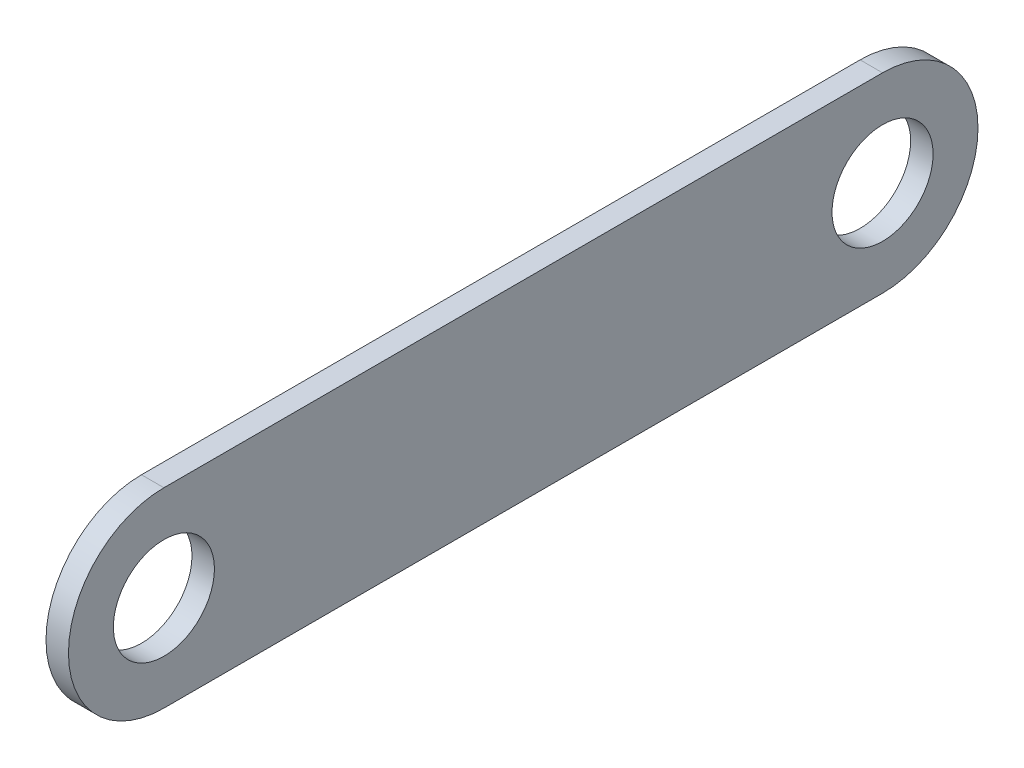
ISO-10303-21;
HEADER;
FILE_DESCRIPTION(('STEP AP214'),'2;1');
FILE_NAME('part.step','',(''),(''),'','','');
FILE_SCHEMA(('AUTOMOTIVE_DESIGN { 1 0 10303 214 1 1 1 1 }'));
ENDSEC;
DATA;
#1=APPLICATION_CONTEXT('core data for automotive mechanical design processes');
#2=APPLICATION_PROTOCOL_DEFINITION('international standard','automotive_design',2000,#1);
#3=PRODUCT_CONTEXT('',#1,'mechanical');
#4=PRODUCT('Part','Part','',(#3));
#5=PRODUCT_RELATED_PRODUCT_CATEGORY('part','',(#4));
#6=PRODUCT_DEFINITION_FORMATION('','',#4);
#7=PRODUCT_DEFINITION_CONTEXT('part definition',#1,'design');
#8=PRODUCT_DEFINITION('design','',#6,#7);
#9=PRODUCT_DEFINITION_SHAPE('','',#8);
#10=(LENGTH_UNIT() NAMED_UNIT(*) SI_UNIT(.MILLI.,.METRE.));
#11=(NAMED_UNIT(*) PLANE_ANGLE_UNIT() SI_UNIT($,.RADIAN.));
#12=(NAMED_UNIT(*) SI_UNIT($,.STERADIAN.) SOLID_ANGLE_UNIT());
#13=UNCERTAINTY_MEASURE_WITH_UNIT(LENGTH_MEASURE(1.E-05),#10,'distance_accuracy_value','');
#14=(GEOMETRIC_REPRESENTATION_CONTEXT(3) GLOBAL_UNCERTAINTY_ASSIGNED_CONTEXT((#13)) GLOBAL_UNIT_ASSIGNED_CONTEXT((#10,
#11,#12)) REPRESENTATION_CONTEXT('',''));
#15=CARTESIAN_POINT('',(0.,0.,0.));
#16=DIRECTION('',(0.,0.,1.));
#17=DIRECTION('',(1.,0.,0.));
#18=AXIS2_PLACEMENT_3D('',#15,#16,#17);
#19=CARTESIAN_POINT('',(6.35,-26.9875,0.));
#20=DIRECTION('',(0.,1.,0.));
#21=DIRECTION('',(0.,0.,1.));
#22=AXIS2_PLACEMENT_3D('',#19,#20,#21);
#23=PLANE('',#22);
#24=DIRECTION('',(0.,0.,-1.));
#25=VECTOR('',#24,1.);
#26=CARTESIAN_POINT('',(0.,-26.9875,0.));
#27=LINE('',#26,#25);
#28=CARTESIAN_POINT('',(0.,-26.9875,0.));
#29=VERTEX_POINT('',#28);
#30=CARTESIAN_POINT('',(0.,-26.9875,-203.2));
#31=VERTEX_POINT('',#30);
#32=EDGE_CURVE('E103',#29,#31,#27,.T.);
#33=ORIENTED_EDGE('',*,*,#32,.T.);
#34=DIRECTION('',(-1.,0.,0.));
#35=VECTOR('',#34,1.);
#36=CARTESIAN_POINT('',(6.35,-26.9875,-203.2));
#37=LINE('',#36,#35);
#38=CARTESIAN_POINT('',(6.35,-26.9875,-203.2));
#39=VERTEX_POINT('',#38);
#40=EDGE_CURVE('E11',#39,#31,#37,.T.);
#41=ORIENTED_EDGE('',*,*,#40,.F.);
#42=DIRECTION('',(0.,0.,-1.));
#43=VECTOR('',#42,1.);
#44=CARTESIAN_POINT('',(6.35,-26.9875,0.));
#45=LINE('',#44,#43);
#46=CARTESIAN_POINT('',(6.35,-26.9875,0.));
#47=VERTEX_POINT('',#46);
#48=EDGE_CURVE('E82',#47,#39,#45,.T.);
#49=ORIENTED_EDGE('',*,*,#48,.F.);
#50=DIRECTION('',(-1.,0.,0.));
#51=VECTOR('',#50,1.);
#52=CARTESIAN_POINT('',(6.35,-26.9875,0.));
#53=LINE('',#52,#51);
#54=EDGE_CURVE('E93',#47,#29,#53,.T.);
#55=ORIENTED_EDGE('',*,*,#54,.T.);
#56=EDGE_LOOP('',(#33,#41,#49,#55));
#57=FACE_BOUND('',#56,.T.);
#58=ADVANCED_FACE('F34',(#57),#23,.F.);
#59=CARTESIAN_POINT('',(6.35,0.,-203.2));
#60=DIRECTION('',(-1.,0.,0.));
#61=DIRECTION('',(0.,0.,1.));
#62=AXIS2_PLACEMENT_3D('',#59,#60,#61);
#63=CYLINDRICAL_SURFACE('',#62,26.9875);
#64=CARTESIAN_POINT('',(0.,0.,-203.2));
#65=DIRECTION('',(1.,0.,0.));
#66=DIRECTION('',(0.,0.,-1.));
#67=AXIS2_PLACEMENT_3D('',#64,#65,#66);
#68=CIRCLE('',#67,26.9875);
#69=CARTESIAN_POINT('',(0.,26.9875,-203.2));
#70=VERTEX_POINT('',#69);
#71=EDGE_CURVE('E87',#31,#70,#68,.T.);
#72=ORIENTED_EDGE('',*,*,#71,.T.);
#73=DIRECTION('',(-1.,0.,0.));
#74=VECTOR('',#73,1.);
#75=CARTESIAN_POINT('',(6.35,26.9875,-203.2));
#76=LINE('',#75,#74);
#77=CARTESIAN_POINT('',(6.35,26.9875,-203.2));
#78=VERTEX_POINT('',#77);
#79=EDGE_CURVE('E43',#78,#70,#76,.T.);
#80=ORIENTED_EDGE('',*,*,#79,.F.);
#81=CARTESIAN_POINT('',(6.35,0.,-203.2));
#82=DIRECTION('',(1.,0.,0.));
#83=DIRECTION('',(0.,0.,-1.));
#84=AXIS2_PLACEMENT_3D('',#81,#82,#83);
#85=CIRCLE('',#84,26.9875);
#86=EDGE_CURVE('E77',#39,#78,#85,.T.);
#87=ORIENTED_EDGE('',*,*,#86,.F.);
#88=ORIENTED_EDGE('',*,*,#40,.T.);
#89=EDGE_LOOP('',(#72,#80,#87,#88));
#90=FACE_BOUND('',#89,.T.);
#91=ADVANCED_FACE('F86',(#90),#63,.T.);
#92=CARTESIAN_POINT('',(6.35,26.9875,0.));
#93=DIRECTION('',(0.,1.,0.));
#94=DIRECTION('',(0.,0.,1.));
#95=AXIS2_PLACEMENT_3D('',#92,#93,#94);
#96=PLANE('',#95);
#97=DIRECTION('',(0.,0.,-1.));
#98=VECTOR('',#97,1.);
#99=CARTESIAN_POINT('',(0.,26.9875,0.));
#100=LINE('',#99,#98);
#101=CARTESIAN_POINT('',(0.,26.9875,0.));
#102=VERTEX_POINT('',#101);
#103=EDGE_CURVE('E107',#102,#70,#100,.T.);
#104=ORIENTED_EDGE('',*,*,#103,.F.);
#105=DIRECTION('',(-1.,0.,0.));
#106=VECTOR('',#105,1.);
#107=CARTESIAN_POINT('',(6.35,26.9875,0.));
#108=LINE('',#107,#106);
#109=CARTESIAN_POINT('',(6.35,26.9875,0.));
#110=VERTEX_POINT('',#109);
#111=EDGE_CURVE('E67',#110,#102,#108,.T.);
#112=ORIENTED_EDGE('',*,*,#111,.F.);
#113=DIRECTION('',(0.,0.,-1.));
#114=VECTOR('',#113,1.);
#115=CARTESIAN_POINT('',(6.35,26.9875,0.));
#116=LINE('',#115,#114);
#117=EDGE_CURVE('E80',#110,#78,#116,.T.);
#118=ORIENTED_EDGE('',*,*,#117,.T.);
#119=ORIENTED_EDGE('',*,*,#79,.T.);
#120=EDGE_LOOP('',(#104,#112,#118,#119));
#121=FACE_BOUND('',#120,.T.);
#122=ADVANCED_FACE('F91',(#121),#96,.T.);
#123=CARTESIAN_POINT('',(6.35,0.,0.));
#124=DIRECTION('',(-1.,0.,0.));
#125=DIRECTION('',(0.,0.,1.));
#126=AXIS2_PLACEMENT_3D('',#123,#124,#125);
#127=CYLINDRICAL_SURFACE('',#126,14.2875);
#128=CARTESIAN_POINT('',(6.35,0.,0.));
#129=DIRECTION('',(1.,0.,0.));
#130=DIRECTION('',(0.,0.,-1.));
#131=AXIS2_PLACEMENT_3D('',#128,#129,#130);
#132=CIRCLE('',#131,14.2875);
#133=CARTESIAN_POINT('',(6.35,0.,-14.2875));
#134=VERTEX_POINT('',#133);
#135=EDGE_CURVE('E145',#134,#134,#132,.T.);
#136=ORIENTED_EDGE('',*,*,#135,.T.);
#137=EDGE_LOOP('',(#136));
#138=FACE_BOUND('',#137,.T.);
#139=CARTESIAN_POINT('',(0.,0.,0.));
#140=DIRECTION('',(1.,0.,0.));
#141=DIRECTION('',(0.,0.,-1.));
#142=AXIS2_PLACEMENT_3D('',#139,#140,#141);
#143=CIRCLE('',#142,14.2875);
#144=CARTESIAN_POINT('',(0.,0.,-14.2875));
#145=VERTEX_POINT('',#144);
#146=EDGE_CURVE('E100',#145,#145,#143,.T.);
#147=ORIENTED_EDGE('',*,*,#146,.F.);
#148=EDGE_LOOP('',(#147));
#149=FACE_BOUND('',#148,.T.);
#150=ADVANCED_FACE('F134',(#138,#149),#127,.F.);
#151=CARTESIAN_POINT('',(6.35,0.,-203.2));
#152=DIRECTION('',(-1.,0.,0.));
#153=DIRECTION('',(0.,0.,1.));
#154=AXIS2_PLACEMENT_3D('',#151,#152,#153);
#155=CYLINDRICAL_SURFACE('',#154,14.2875);
#156=CARTESIAN_POINT('',(6.35,0.,-203.2));
#157=DIRECTION('',(1.,0.,0.));
#158=DIRECTION('',(0.,0.,-1.));
#159=AXIS2_PLACEMENT_3D('',#156,#157,#158);
#160=CIRCLE('',#159,14.2875);
#161=CARTESIAN_POINT('',(6.35,0.,-217.4875));
#162=VERTEX_POINT('',#161);
#163=EDGE_CURVE('E110',#162,#162,#160,.T.);
#164=ORIENTED_EDGE('',*,*,#163,.T.);
#165=EDGE_LOOP('',(#164));
#166=FACE_BOUND('',#165,.T.);
#167=CARTESIAN_POINT('',(0.,0.,-203.2));
#168=DIRECTION('',(1.,0.,0.));
#169=DIRECTION('',(0.,0.,-1.));
#170=AXIS2_PLACEMENT_3D('',#167,#168,#169);
#171=CIRCLE('',#170,14.2875);
#172=CARTESIAN_POINT('',(0.,0.,-217.4875));
#173=VERTEX_POINT('',#172);
#174=EDGE_CURVE('E97',#173,#173,#171,.T.);
#175=ORIENTED_EDGE('',*,*,#174,.F.);
#176=EDGE_LOOP('',(#175));
#177=FACE_BOUND('',#176,.T.);
#178=ADVANCED_FACE('F36',(#166,#177),#155,.F.);
#179=CARTESIAN_POINT('',(6.35,0.,0.));
#180=DIRECTION('',(-1.,0.,0.));
#181=DIRECTION('',(0.,0.,1.));
#182=AXIS2_PLACEMENT_3D('',#179,#180,#181);
#183=CYLINDRICAL_SURFACE('',#182,26.9875);
#184=CARTESIAN_POINT('',(0.,0.,0.));
#185=DIRECTION('',(1.,0.,0.));
#186=DIRECTION('',(0.,0.,-1.));
#187=AXIS2_PLACEMENT_3D('',#184,#185,#186);
#188=CIRCLE('',#187,26.9875);
#189=EDGE_CURVE('E70',#102,#29,#188,.T.);
#190=ORIENTED_EDGE('',*,*,#189,.T.);
#191=ORIENTED_EDGE('',*,*,#54,.F.);
#192=CARTESIAN_POINT('',(6.35,0.,0.));
#193=DIRECTION('',(1.,0.,0.));
#194=DIRECTION('',(0.,0.,-1.));
#195=AXIS2_PLACEMENT_3D('',#192,#193,#194);
#196=CIRCLE('',#195,26.9875);
#197=EDGE_CURVE('E51',#110,#47,#196,.T.);
#198=ORIENTED_EDGE('',*,*,#197,.F.);
#199=ORIENTED_EDGE('',*,*,#111,.T.);
#200=EDGE_LOOP('',(#190,#191,#198,#199));
#201=FACE_BOUND('',#200,.T.);
#202=ADVANCED_FACE('F122',(#201),#183,.T.);
#203=CARTESIAN_POINT('',(6.35,0.,0.));
#204=DIRECTION('',(1.,0.,0.));
#205=DIRECTION('',(0.,0.,-1.));
#206=AXIS2_PLACEMENT_3D('',#203,#204,#205);
#207=PLANE('',#206);
#208=ORIENTED_EDGE('',*,*,#163,.F.);
#209=EDGE_LOOP('',(#208));
#210=FACE_BOUND('',#209,.T.);
#211=ORIENTED_EDGE('',*,*,#135,.F.);
#212=EDGE_LOOP('',(#211));
#213=FACE_BOUND('',#212,.T.);
#214=ORIENTED_EDGE('',*,*,#48,.T.);
#215=ORIENTED_EDGE('',*,*,#86,.T.);
#216=ORIENTED_EDGE('',*,*,#117,.F.);
#217=ORIENTED_EDGE('',*,*,#197,.T.);
#218=EDGE_LOOP('',(#214,#215,#216,#217));
#219=FACE_BOUND('',#218,.T.);
#220=ADVANCED_FACE('F78',(#210,#213,#219),#207,.T.);
#221=CARTESIAN_POINT('',(0.,0.,0.));
#222=DIRECTION('',(1.,0.,0.));
#223=DIRECTION('',(0.,0.,-1.));
#224=AXIS2_PLACEMENT_3D('',#221,#222,#223);
#225=PLANE('',#224);
#226=ORIENTED_EDGE('',*,*,#174,.T.);
#227=EDGE_LOOP('',(#226));
#228=FACE_BOUND('',#227,.T.);
#229=ORIENTED_EDGE('',*,*,#146,.T.);
#230=EDGE_LOOP('',(#229));
#231=FACE_BOUND('',#230,.T.);
#232=ORIENTED_EDGE('',*,*,#32,.F.);
#233=ORIENTED_EDGE('',*,*,#189,.F.);
#234=ORIENTED_EDGE('',*,*,#103,.T.);
#235=ORIENTED_EDGE('',*,*,#71,.F.);
#236=EDGE_LOOP('',(#232,#233,#234,#235));
#237=FACE_BOUND('',#236,.T.);
#238=ADVANCED_FACE('F115',(#228,#231,#237),#225,.F.);
#239=CLOSED_SHELL('',(#58,#91,#122,#150,#178,#202,#220,#238));
#240=MANIFOLD_SOLID_BREP('B2',#239);
#241=ADVANCED_BREP_SHAPE_REPRESENTATION('',(#18,#240),#14);
#242=SHAPE_DEFINITION_REPRESENTATION(#9,#241);
ENDSEC;
END-ISO-10303-21;
